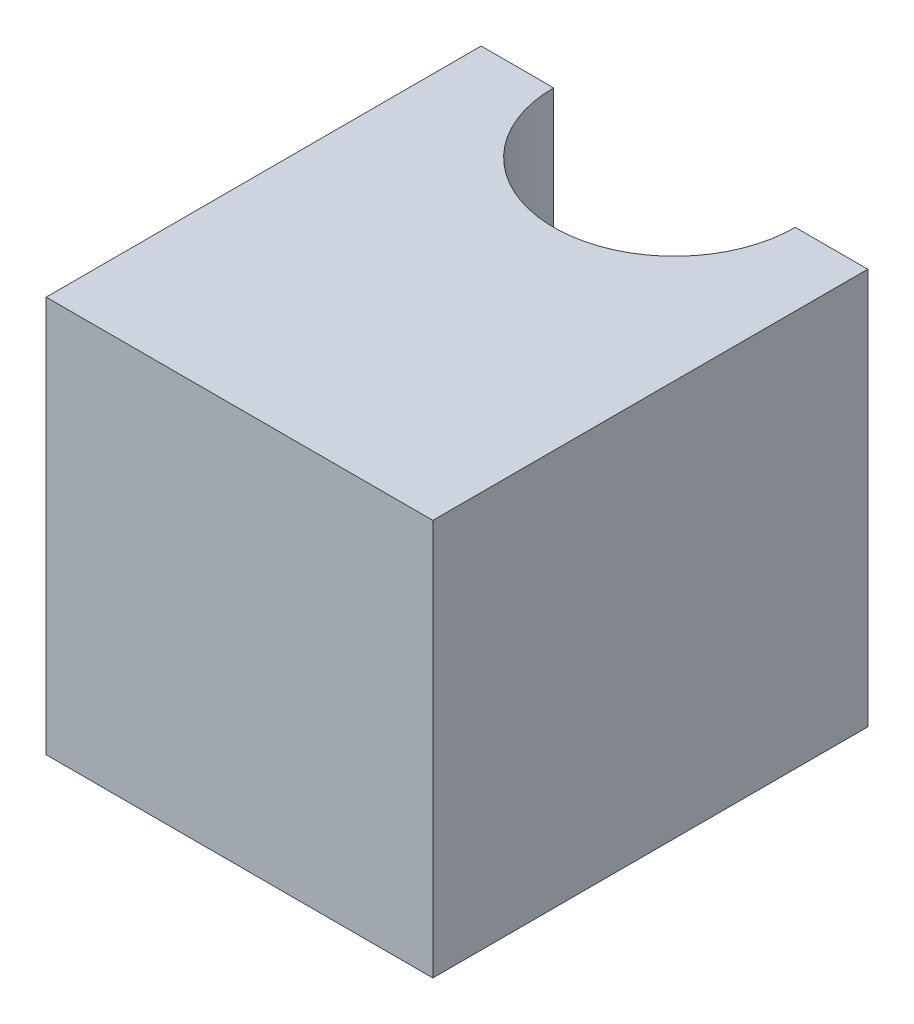
ISO-10303-21;
HEADER;
FILE_DESCRIPTION(('STEP AP214'),'2;1');
FILE_NAME('part.step','',(''),(''),'','','');
FILE_SCHEMA(('AUTOMOTIVE_DESIGN { 1 0 10303 214 1 1 1 1 }'));
ENDSEC;
DATA;
#1=APPLICATION_CONTEXT('core data for automotive mechanical design processes');
#2=APPLICATION_PROTOCOL_DEFINITION('international standard','automotive_design',2000,#1);
#3=PRODUCT_CONTEXT('',#1,'mechanical');
#4=PRODUCT('Part','Part','',(#3));
#5=PRODUCT_RELATED_PRODUCT_CATEGORY('part','',(#4));
#6=PRODUCT_DEFINITION_FORMATION('','',#4);
#7=PRODUCT_DEFINITION_CONTEXT('part definition',#1,'design');
#8=PRODUCT_DEFINITION('design','',#6,#7);
#9=PRODUCT_DEFINITION_SHAPE('','',#8);
#10=(LENGTH_UNIT() NAMED_UNIT(*) SI_UNIT(.MILLI.,.METRE.));
#11=(NAMED_UNIT(*) PLANE_ANGLE_UNIT() SI_UNIT($,.RADIAN.));
#12=(NAMED_UNIT(*) SI_UNIT($,.STERADIAN.) SOLID_ANGLE_UNIT());
#13=UNCERTAINTY_MEASURE_WITH_UNIT(LENGTH_MEASURE(1.E-05),#10,'distance_accuracy_value','');
#14=(GEOMETRIC_REPRESENTATION_CONTEXT(3) GLOBAL_UNCERTAINTY_ASSIGNED_CONTEXT((#13)) GLOBAL_UNIT_ASSIGNED_CONTEXT((#10,
#11,#12)) REPRESENTATION_CONTEXT('',''));
#15=CARTESIAN_POINT('',(0.,0.,0.));
#16=DIRECTION('',(0.,0.,1.));
#17=DIRECTION('',(1.,0.,0.));
#18=AXIS2_PLACEMENT_3D('',#15,#16,#17);
#19=CARTESIAN_POINT('',(6.3,0.,-5.2));
#20=DIRECTION('',(1.,0.,0.));
#21=DIRECTION('',(0.,0.,-1.));
#22=AXIS2_PLACEMENT_3D('',#19,#20,#21);
#23=PLANE('',#22);
#24=DIRECTION('',(0.,0.,1.));
#25=VECTOR('',#24,1.);
#26=CARTESIAN_POINT('',(6.3,0.82,-5.65));
#27=LINE('',#26,#25);
#28=CARTESIAN_POINT('',(6.3,0.82,-5.2));
#29=VERTEX_POINT('',#28);
#30=CARTESIAN_POINT('',(6.3,0.82,-6.1));
#31=VERTEX_POINT('',#30);
#32=EDGE_CURVE('E108',#29,#31,#27,.F.);
#33=ORIENTED_EDGE('',*,*,#32,.F.);
#34=DIRECTION('',(0.,1.,0.));
#35=VECTOR('',#34,1.);
#36=CARTESIAN_POINT('',(6.3,0.,-5.2));
#37=LINE('',#36,#35);
#38=CARTESIAN_POINT('',(6.3,0.,-5.2));
#39=VERTEX_POINT('',#38);
#40=EDGE_CURVE('E92',#39,#29,#37,.T.);
#41=ORIENTED_EDGE('',*,*,#40,.F.);
#42=DIRECTION('',(0.,0.,1.));
#43=VECTOR('',#42,1.);
#44=CARTESIAN_POINT('',(6.3,0.,-5.65));
#45=LINE('',#44,#43);
#46=CARTESIAN_POINT('',(6.3,0.,-6.1));
#47=VERTEX_POINT('',#46);
#48=EDGE_CURVE('E76',#39,#47,#45,.F.);
#49=ORIENTED_EDGE('',*,*,#48,.T.);
#50=DIRECTION('',(0.,1.,0.));
#51=VECTOR('',#50,1.);
#52=CARTESIAN_POINT('',(6.3,0.,-6.1));
#53=LINE('',#52,#51);
#54=EDGE_CURVE('E73',#31,#47,#53,.F.);
#55=ORIENTED_EDGE('',*,*,#54,.F.);
#56=EDGE_LOOP('',(#33,#41,#49,#55));
#57=FACE_BOUND('',#56,.T.);
#58=ADVANCED_FACE('F17',(#57),#23,.T.);
#59=CARTESIAN_POINT('',(6.3,0.,-6.1));
#60=DIRECTION('',(0.,0.,-1.));
#61=DIRECTION('',(-1.,0.,0.));
#62=AXIS2_PLACEMENT_3D('',#59,#60,#61);
#63=PLANE('',#62);
#64=DIRECTION('',(1.,0.,0.));
#65=VECTOR('',#64,1.);
#66=CARTESIAN_POINT('',(5.9,0.82,-6.1));
#67=LINE('',#66,#65);
#68=CARTESIAN_POINT('',(6.15,0.82,-6.1));
#69=VERTEX_POINT('',#68);
#70=EDGE_CURVE('E106',#31,#69,#67,.F.);
#71=ORIENTED_EDGE('',*,*,#70,.F.);
#72=ORIENTED_EDGE('',*,*,#54,.T.);
#73=DIRECTION('',(1.,0.,0.));
#74=VECTOR('',#73,1.);
#75=CARTESIAN_POINT('',(5.9,0.,-6.1));
#76=LINE('',#75,#74);
#77=CARTESIAN_POINT('',(6.15,0.,-6.1));
#78=VERTEX_POINT('',#77);
#79=EDGE_CURVE('E67',#47,#78,#76,.F.);
#80=ORIENTED_EDGE('',*,*,#79,.T.);
#81=DIRECTION('',(0.,1.,0.));
#82=VECTOR('',#81,1.);
#83=CARTESIAN_POINT('',(6.15,0.,-6.1));
#84=LINE('',#83,#82);
#85=EDGE_CURVE('E71',#78,#69,#84,.T.);
#86=ORIENTED_EDGE('',*,*,#85,.T.);
#87=EDGE_LOOP('',(#71,#72,#80,#86));
#88=FACE_BOUND('',#87,.T.);
#89=ADVANCED_FACE('F70',(#88),#63,.T.);
#90=CARTESIAN_POINT('',(5.9,0.,-6.1));
#91=DIRECTION('',(0.,1.,0.));
#92=DIRECTION('',(0.,0.,1.));
#93=AXIS2_PLACEMENT_3D('',#90,#91,#92);
#94=CYLINDRICAL_SURFACE('',#93,0.25);
#95=DIRECTION('',(0.,1.,0.));
#96=VECTOR('',#95,1.);
#97=CARTESIAN_POINT('',(5.65,0.,-6.1));
#98=LINE('',#97,#96);
#99=CARTESIAN_POINT('',(5.65,0.82,-6.1));
#100=VERTEX_POINT('',#99);
#101=CARTESIAN_POINT('',(5.65,0.,-6.1));
#102=VERTEX_POINT('',#101);
#103=EDGE_CURVE('E117',#100,#102,#98,.F.);
#104=ORIENTED_EDGE('',*,*,#103,.F.);
#105=CARTESIAN_POINT('',(5.9,0.82,-6.1));
#106=DIRECTION('',(0.,1.,0.));
#107=DIRECTION('',(0.,0.,1.));
#108=AXIS2_PLACEMENT_3D('',#105,#106,#107);
#109=CIRCLE('',#108,0.25);
#110=EDGE_CURVE('E83',#69,#100,#109,.F.);
#111=ORIENTED_EDGE('',*,*,#110,.F.);
#112=ORIENTED_EDGE('',*,*,#85,.F.);
#113=CARTESIAN_POINT('',(5.9,0.,-6.1));
#114=DIRECTION('',(0.,1.,0.));
#115=DIRECTION('',(0.,0.,1.));
#116=AXIS2_PLACEMENT_3D('',#113,#114,#115);
#117=CIRCLE('',#116,0.25);
#118=EDGE_CURVE('E20',#78,#102,#117,.F.);
#119=ORIENTED_EDGE('',*,*,#118,.T.);
#120=EDGE_LOOP('',(#104,#111,#112,#119));
#121=FACE_BOUND('',#120,.T.);
#122=ADVANCED_FACE('F81',(#121),#94,.F.);
#123=CARTESIAN_POINT('',(5.9,0.,-5.65));
#124=DIRECTION('',(0.,1.,0.));
#125=DIRECTION('',(0.,0.,1.));
#126=AXIS2_PLACEMENT_3D('',#123,#124,#125);
#127=PLANE('',#126);
#128=DIRECTION('',(0.,0.,1.));
#129=VECTOR('',#128,1.);
#130=CARTESIAN_POINT('',(5.5,0.,-6.1));
#131=LINE('',#130,#129);
#132=CARTESIAN_POINT('',(5.5,0.,-6.1));
#133=VERTEX_POINT('',#132);
#134=CARTESIAN_POINT('',(5.5,0.,-5.2));
#135=VERTEX_POINT('',#134);
#136=EDGE_CURVE('E119',#133,#135,#131,.T.);
#137=ORIENTED_EDGE('',*,*,#136,.F.);
#138=DIRECTION('',(-1.,0.,0.));
#139=VECTOR('',#138,1.);
#140=CARTESIAN_POINT('',(5.65,0.,-6.1));
#141=LINE('',#140,#139);
#142=EDGE_CURVE('E88',#102,#133,#141,.T.);
#143=ORIENTED_EDGE('',*,*,#142,.F.);
#144=ORIENTED_EDGE('',*,*,#118,.F.);
#145=ORIENTED_EDGE('',*,*,#79,.F.);
#146=ORIENTED_EDGE('',*,*,#48,.F.);
#147=DIRECTION('',(1.,0.,0.));
#148=VECTOR('',#147,1.);
#149=CARTESIAN_POINT('',(5.5,0.,-5.2));
#150=LINE('',#149,#148);
#151=EDGE_CURVE('E90',#135,#39,#150,.T.);
#152=ORIENTED_EDGE('',*,*,#151,.F.);
#153=EDGE_LOOP('',(#137,#143,#144,#145,#146,#152));
#154=FACE_BOUND('',#153,.T.);
#155=ADVANCED_FACE('F86',(#154),#127,.F.);
#156=CARTESIAN_POINT('',(5.5,0.,-5.2));
#157=DIRECTION('',(0.,0.,1.));
#158=DIRECTION('',(1.,0.,0.));
#159=AXIS2_PLACEMENT_3D('',#156,#157,#158);
#160=PLANE('',#159);
#161=DIRECTION('',(1.,0.,0.));
#162=VECTOR('',#161,1.);
#163=CARTESIAN_POINT('',(5.9,0.82,-5.2));
#164=LINE('',#163,#162);
#165=CARTESIAN_POINT('',(5.5,0.82,-5.2));
#166=VERTEX_POINT('',#165);
#167=EDGE_CURVE('E96',#166,#29,#164,.T.);
#168=ORIENTED_EDGE('',*,*,#167,.F.);
#169=DIRECTION('',(0.,1.,0.));
#170=VECTOR('',#169,1.);
#171=CARTESIAN_POINT('',(5.5,0.,-5.2));
#172=LINE('',#171,#170);
#173=EDGE_CURVE('E127',#135,#166,#172,.T.);
#174=ORIENTED_EDGE('',*,*,#173,.F.);
#175=ORIENTED_EDGE('',*,*,#151,.T.);
#176=ORIENTED_EDGE('',*,*,#40,.T.);
#177=EDGE_LOOP('',(#168,#174,#175,#176));
#178=FACE_BOUND('',#177,.T.);
#179=ADVANCED_FACE('F149',(#178),#160,.T.);
#180=CARTESIAN_POINT('',(5.9,0.82,-5.65));
#181=DIRECTION('',(0.,1.,0.));
#182=DIRECTION('',(0.,0.,1.));
#183=AXIS2_PLACEMENT_3D('',#180,#181,#182);
#184=PLANE('',#183);
#185=DIRECTION('',(-1.,0.,0.));
#186=VECTOR('',#185,1.);
#187=CARTESIAN_POINT('',(5.65,0.82,-6.1));
#188=LINE('',#187,#186);
#189=CARTESIAN_POINT('',(5.5,0.82,-6.1));
#190=VERTEX_POINT('',#189);
#191=EDGE_CURVE('E35',#190,#100,#188,.F.);
#192=ORIENTED_EDGE('',*,*,#191,.F.);
#193=DIRECTION('',(0.,0.,1.));
#194=VECTOR('',#193,1.);
#195=CARTESIAN_POINT('',(5.5,0.82,-6.1));
#196=LINE('',#195,#194);
#197=EDGE_CURVE('E26',#166,#190,#196,.F.);
#198=ORIENTED_EDGE('',*,*,#197,.F.);
#199=ORIENTED_EDGE('',*,*,#167,.T.);
#200=ORIENTED_EDGE('',*,*,#32,.T.);
#201=ORIENTED_EDGE('',*,*,#70,.T.);
#202=ORIENTED_EDGE('',*,*,#110,.T.);
#203=EDGE_LOOP('',(#192,#198,#199,#200,#201,#202));
#204=FACE_BOUND('',#203,.T.);
#205=ADVANCED_FACE('F152',(#204),#184,.T.);
#206=CARTESIAN_POINT('',(5.65,0.,-6.1));
#207=DIRECTION('',(0.,0.,-1.));
#208=DIRECTION('',(-1.,0.,0.));
#209=AXIS2_PLACEMENT_3D('',#206,#207,#208);
#210=PLANE('',#209);
#211=ORIENTED_EDGE('',*,*,#191,.T.);
#212=ORIENTED_EDGE('',*,*,#103,.T.);
#213=ORIENTED_EDGE('',*,*,#142,.T.);
#214=DIRECTION('',(0.,1.,0.));
#215=VECTOR('',#214,1.);
#216=CARTESIAN_POINT('',(5.5,0.,-6.1));
#217=LINE('',#216,#215);
#218=EDGE_CURVE('E11',#190,#133,#217,.F.);
#219=ORIENTED_EDGE('',*,*,#218,.F.);
#220=EDGE_LOOP('',(#211,#212,#213,#219));
#221=FACE_BOUND('',#220,.T.);
#222=ADVANCED_FACE('F154',(#221),#210,.T.);
#223=CARTESIAN_POINT('',(5.5,0.,-6.1));
#224=DIRECTION('',(-1.,0.,0.));
#225=DIRECTION('',(0.,0.,1.));
#226=AXIS2_PLACEMENT_3D('',#223,#224,#225);
#227=PLANE('',#226);
#228=ORIENTED_EDGE('',*,*,#197,.T.);
#229=ORIENTED_EDGE('',*,*,#218,.T.);
#230=ORIENTED_EDGE('',*,*,#136,.T.);
#231=ORIENTED_EDGE('',*,*,#173,.T.);
#232=EDGE_LOOP('',(#228,#229,#230,#231));
#233=FACE_BOUND('',#232,.T.);
#234=ADVANCED_FACE('F148',(#233),#227,.T.);
#235=CLOSED_SHELL('',(#58,#89,#122,#155,#179,#205,#222,#234));
#236=MANIFOLD_SOLID_BREP('B1',#235);
#237=ADVANCED_BREP_SHAPE_REPRESENTATION('',(#18,#236),#14);
#238=SHAPE_DEFINITION_REPRESENTATION(#9,#237);
ENDSEC;
END-ISO-10303-21;
